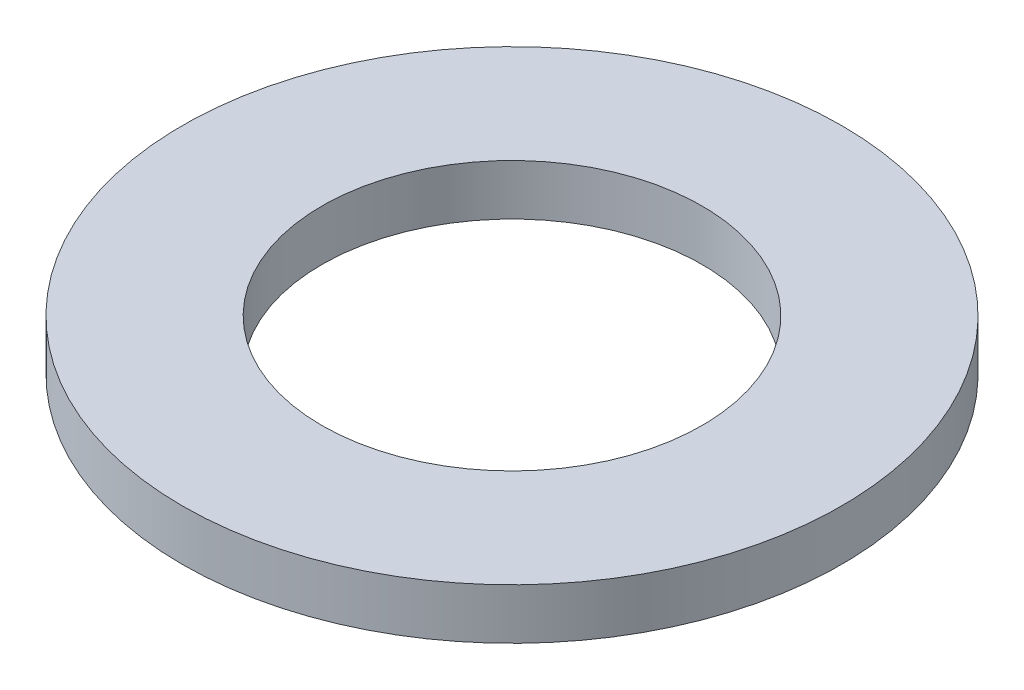
ISO-10303-21;
HEADER;
FILE_DESCRIPTION(('STEP AP214'),'2;1');
FILE_NAME('part.step','',(''),(''),'','','');
FILE_SCHEMA(('AUTOMOTIVE_DESIGN { 1 0 10303 214 1 1 1 1 }'));
ENDSEC;
DATA;
#1=APPLICATION_CONTEXT('core data for automotive mechanical design processes');
#2=APPLICATION_PROTOCOL_DEFINITION('international standard','automotive_design',2000,#1);
#3=PRODUCT_CONTEXT('',#1,'mechanical');
#4=PRODUCT('Part','Part','',(#3));
#5=PRODUCT_RELATED_PRODUCT_CATEGORY('part','',(#4));
#6=PRODUCT_DEFINITION_FORMATION('','',#4);
#7=PRODUCT_DEFINITION_CONTEXT('part definition',#1,'design');
#8=PRODUCT_DEFINITION('design','',#6,#7);
#9=PRODUCT_DEFINITION_SHAPE('','',#8);
#10=(LENGTH_UNIT() NAMED_UNIT(*) SI_UNIT(.MILLI.,.METRE.));
#11=(NAMED_UNIT(*) PLANE_ANGLE_UNIT() SI_UNIT($,.RADIAN.));
#12=(NAMED_UNIT(*) SI_UNIT($,.STERADIAN.) SOLID_ANGLE_UNIT());
#13=UNCERTAINTY_MEASURE_WITH_UNIT(LENGTH_MEASURE(1.E-05),#10,'distance_accuracy_value','');
#14=(GEOMETRIC_REPRESENTATION_CONTEXT(3) GLOBAL_UNCERTAINTY_ASSIGNED_CONTEXT((#13)) GLOBAL_UNIT_ASSIGNED_CONTEXT((#10,
#11,#12)) REPRESENTATION_CONTEXT('',''));
#15=CARTESIAN_POINT('',(0.,0.,0.));
#16=DIRECTION('',(0.,0.,1.));
#17=DIRECTION('',(1.,0.,0.));
#18=AXIS2_PLACEMENT_3D('',#15,#16,#17);
#19=CARTESIAN_POINT('',(0.,10.,0.));
#20=DIRECTION('',(0.,-1.,0.));
#21=DIRECTION('',(0.,0.,-1.));
#22=AXIS2_PLACEMENT_3D('',#19,#20,#21);
#23=CYLINDRICAL_SURFACE('',#22,65.);
#24=CARTESIAN_POINT('',(0.,10.,0.));
#25=DIRECTION('',(0.,1.,0.));
#26=DIRECTION('',(0.,0.,1.));
#27=AXIS2_PLACEMENT_3D('',#24,#25,#26);
#28=CIRCLE('',#27,65.);
#29=CARTESIAN_POINT('',(0.,10.,65.));
#30=VERTEX_POINT('',#29);
#31=EDGE_CURVE('E10',#30,#30,#28,.T.);
#32=ORIENTED_EDGE('',*,*,#31,.F.);
#33=EDGE_LOOP('',(#32));
#34=FACE_BOUND('',#33,.T.);
#35=CARTESIAN_POINT('',(0.,0.,0.));
#36=DIRECTION('',(0.,1.,0.));
#37=DIRECTION('',(0.,0.,1.));
#38=AXIS2_PLACEMENT_3D('',#35,#36,#37);
#39=CIRCLE('',#38,65.);
#40=CARTESIAN_POINT('',(0.,0.,65.));
#41=VERTEX_POINT('',#40);
#42=EDGE_CURVE('E37',#41,#41,#39,.T.);
#43=ORIENTED_EDGE('',*,*,#42,.T.);
#44=EDGE_LOOP('',(#43));
#45=FACE_BOUND('',#44,.T.);
#46=ADVANCED_FACE('F40',(#34,#45),#23,.T.);
#47=CARTESIAN_POINT('',(0.,10.,0.));
#48=DIRECTION('',(0.,1.,0.));
#49=DIRECTION('',(0.,0.,1.));
#50=AXIS2_PLACEMENT_3D('',#47,#48,#49);
#51=PLANE('',#50);
#52=CARTESIAN_POINT('',(0.,10.,0.));
#53=DIRECTION('',(0.,1.,0.));
#54=DIRECTION('',(0.,0.,1.));
#55=AXIS2_PLACEMENT_3D('',#52,#53,#54);
#56=CIRCLE('',#55,37.5);
#57=CARTESIAN_POINT('',(0.,10.,37.5));
#58=VERTEX_POINT('',#57);
#59=EDGE_CURVE('E50',#58,#58,#56,.T.);
#60=ORIENTED_EDGE('',*,*,#59,.F.);
#61=EDGE_LOOP('',(#60));
#62=FACE_BOUND('',#61,.T.);
#63=ORIENTED_EDGE('',*,*,#31,.T.);
#64=EDGE_LOOP('',(#63));
#65=FACE_BOUND('',#64,.T.);
#66=ADVANCED_FACE('F59',(#62,#65),#51,.T.);
#67=CARTESIAN_POINT('',(0.,0.,0.));
#68=DIRECTION('',(0.,1.,0.));
#69=DIRECTION('',(0.,0.,1.));
#70=AXIS2_PLACEMENT_3D('',#67,#68,#69);
#71=PLANE('',#70);
#72=CARTESIAN_POINT('',(0.,0.,0.));
#73=DIRECTION('',(0.,1.,0.));
#74=DIRECTION('',(0.,0.,1.));
#75=AXIS2_PLACEMENT_3D('',#72,#73,#74);
#76=CIRCLE('',#75,37.5);
#77=CARTESIAN_POINT('',(0.,0.,37.5));
#78=VERTEX_POINT('',#77);
#79=EDGE_CURVE('E47',#78,#78,#76,.T.);
#80=ORIENTED_EDGE('',*,*,#79,.T.);
#81=EDGE_LOOP('',(#80));
#82=FACE_BOUND('',#81,.T.);
#83=ORIENTED_EDGE('',*,*,#42,.F.);
#84=EDGE_LOOP('',(#83));
#85=FACE_BOUND('',#84,.T.);
#86=ADVANCED_FACE('F58',(#82,#85),#71,.F.);
#87=CARTESIAN_POINT('',(0.,10.,0.));
#88=DIRECTION('',(0.,-1.,0.));
#89=DIRECTION('',(0.,0.,-1.));
#90=AXIS2_PLACEMENT_3D('',#87,#88,#89);
#91=CYLINDRICAL_SURFACE('',#90,37.5);
#92=ORIENTED_EDGE('',*,*,#59,.T.);
#93=EDGE_LOOP('',(#92));
#94=FACE_BOUND('',#93,.T.);
#95=ORIENTED_EDGE('',*,*,#79,.F.);
#96=EDGE_LOOP('',(#95));
#97=FACE_BOUND('',#96,.T.);
#98=ADVANCED_FACE('F54',(#94,#97),#91,.F.);
#99=CLOSED_SHELL('',(#46,#66,#86,#98));
#100=MANIFOLD_SOLID_BREP('B2',#99);
#101=ADVANCED_BREP_SHAPE_REPRESENTATION('',(#18,#100),#14);
#102=SHAPE_DEFINITION_REPRESENTATION(#9,#101);
ENDSEC;
END-ISO-10303-21;
